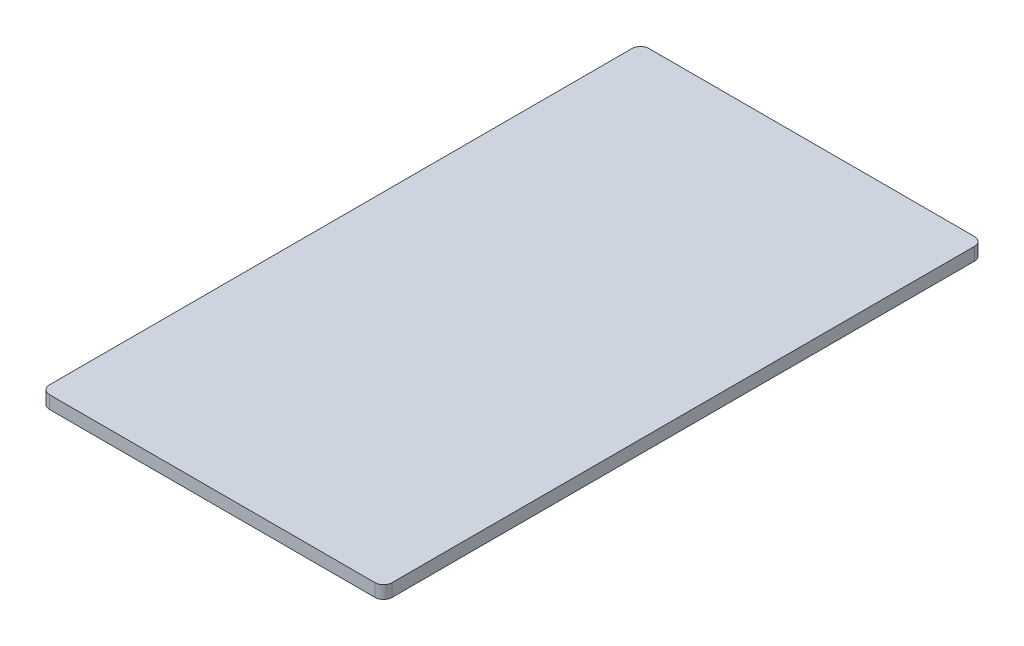
ISO-10303-21;
HEADER;
FILE_DESCRIPTION(('STEP AP214'),'2;1');
FILE_NAME('part.step','',(''),(''),'','','');
FILE_SCHEMA(('AUTOMOTIVE_DESIGN { 1 0 10303 214 1 1 1 1 }'));
ENDSEC;
DATA;
#1=APPLICATION_CONTEXT('core data for automotive mechanical design processes');
#2=APPLICATION_PROTOCOL_DEFINITION('international standard','automotive_design',2000,#1);
#3=PRODUCT_CONTEXT('',#1,'mechanical');
#4=PRODUCT('Part','Part','',(#3));
#5=PRODUCT_RELATED_PRODUCT_CATEGORY('part','',(#4));
#6=PRODUCT_DEFINITION_FORMATION('','',#4);
#7=PRODUCT_DEFINITION_CONTEXT('part definition',#1,'design');
#8=PRODUCT_DEFINITION('design','',#6,#7);
#9=PRODUCT_DEFINITION_SHAPE('','',#8);
#10=(LENGTH_UNIT() NAMED_UNIT(*) SI_UNIT(.MILLI.,.METRE.));
#11=(NAMED_UNIT(*) PLANE_ANGLE_UNIT() SI_UNIT($,.RADIAN.));
#12=(NAMED_UNIT(*) SI_UNIT($,.STERADIAN.) SOLID_ANGLE_UNIT());
#13=UNCERTAINTY_MEASURE_WITH_UNIT(LENGTH_MEASURE(1.E-05),#10,'distance_accuracy_value','');
#14=(GEOMETRIC_REPRESENTATION_CONTEXT(3) GLOBAL_UNCERTAINTY_ASSIGNED_CONTEXT((#13)) GLOBAL_UNIT_ASSIGNED_CONTEXT((#10,
#11,#12)) REPRESENTATION_CONTEXT('',''));
#15=CARTESIAN_POINT('',(0.,0.,0.));
#16=DIRECTION('',(0.,0.,1.));
#17=DIRECTION('',(1.,0.,0.));
#18=AXIS2_PLACEMENT_3D('',#15,#16,#17);
#19=CARTESIAN_POINT('',(20.,1.5,-35.));
#20=DIRECTION('',(-1.,0.,0.));
#21=DIRECTION('',(0.,0.,1.));
#22=AXIS2_PLACEMENT_3D('',#19,#20,#21);
#23=PLANE('',#22);
#24=DIRECTION('',(0.,0.,-1.));
#25=VECTOR('',#24,1.);
#26=CARTESIAN_POINT('',(20.,0.,-35.));
#27=LINE('',#26,#25);
#28=CARTESIAN_POINT('',(20.,0.,34.));
#29=VERTEX_POINT('',#28);
#30=CARTESIAN_POINT('',(20.,0.,-34.));
#31=VERTEX_POINT('',#30);
#32=EDGE_CURVE('E127',#29,#31,#27,.T.);
#33=ORIENTED_EDGE('',*,*,#32,.T.);
#34=DIRECTION('',(0.,-1.,0.));
#35=VECTOR('',#34,1.);
#36=CARTESIAN_POINT('',(20.,1.5,-34.));
#37=LINE('',#36,#35);
#38=CARTESIAN_POINT('',(20.,1.5,-34.));
#39=VERTEX_POINT('',#38);
#40=EDGE_CURVE('E105',#31,#39,#37,.F.);
#41=ORIENTED_EDGE('',*,*,#40,.T.);
#42=DIRECTION('',(0.,0.,-1.));
#43=VECTOR('',#42,1.);
#44=CARTESIAN_POINT('',(20.,1.5,-35.));
#45=LINE('',#44,#43);
#46=CARTESIAN_POINT('',(20.,1.5,34.));
#47=VERTEX_POINT('',#46);
#48=EDGE_CURVE('E136',#47,#39,#45,.T.);
#49=ORIENTED_EDGE('',*,*,#48,.F.);
#50=DIRECTION('',(0.,-1.,0.));
#51=VECTOR('',#50,1.);
#52=CARTESIAN_POINT('',(20.,1.5,34.));
#53=LINE('',#52,#51);
#54=EDGE_CURVE('E110',#47,#29,#53,.T.);
#55=ORIENTED_EDGE('',*,*,#54,.T.);
#56=EDGE_LOOP('',(#33,#41,#49,#55));
#57=FACE_BOUND('',#56,.T.);
#58=ADVANCED_FACE('F35',(#57),#23,.F.);
#59=CARTESIAN_POINT('',(-20.,1.5,-35.));
#60=DIRECTION('',(0.,0.,1.));
#61=DIRECTION('',(1.,0.,0.));
#62=AXIS2_PLACEMENT_3D('',#59,#60,#61);
#63=PLANE('',#62);
#64=DIRECTION('',(-1.,0.,0.));
#65=VECTOR('',#64,1.);
#66=CARTESIAN_POINT('',(-20.,1.5,-35.));
#67=LINE('',#66,#65);
#68=CARTESIAN_POINT('',(19.,1.5,-35.));
#69=VERTEX_POINT('',#68);
#70=CARTESIAN_POINT('',(-19.,1.5,-35.));
#71=VERTEX_POINT('',#70);
#72=EDGE_CURVE('E120',#69,#71,#67,.T.);
#73=ORIENTED_EDGE('',*,*,#72,.F.);
#74=DIRECTION('',(0.,-1.,0.));
#75=VECTOR('',#74,1.);
#76=CARTESIAN_POINT('',(19.,1.5,-35.));
#77=LINE('',#76,#75);
#78=CARTESIAN_POINT('',(19.,0.,-35.));
#79=VERTEX_POINT('',#78);
#80=EDGE_CURVE('E104',#69,#79,#77,.T.);
#81=ORIENTED_EDGE('',*,*,#80,.T.);
#82=DIRECTION('',(-1.,0.,0.));
#83=VECTOR('',#82,1.);
#84=CARTESIAN_POINT('',(-20.,0.,-35.));
#85=LINE('',#84,#83);
#86=CARTESIAN_POINT('',(-19.,0.,-35.));
#87=VERTEX_POINT('',#86);
#88=EDGE_CURVE('E117',#79,#87,#85,.T.);
#89=ORIENTED_EDGE('',*,*,#88,.T.);
#90=DIRECTION('',(0.,-1.,0.));
#91=VECTOR('',#90,1.);
#92=CARTESIAN_POINT('',(-19.,1.5,-35.));
#93=LINE('',#92,#91);
#94=EDGE_CURVE('E122',#87,#71,#93,.F.);
#95=ORIENTED_EDGE('',*,*,#94,.T.);
#96=EDGE_LOOP('',(#73,#81,#89,#95));
#97=FACE_BOUND('',#96,.T.);
#98=ADVANCED_FACE('F116',(#97),#63,.F.);
#99=CARTESIAN_POINT('',(-20.,1.5,-35.));
#100=DIRECTION('',(1.,0.,0.));
#101=DIRECTION('',(0.,0.,-1.));
#102=AXIS2_PLACEMENT_3D('',#99,#100,#101);
#103=PLANE('',#102);
#104=DIRECTION('',(0.,0.,1.));
#105=VECTOR('',#104,1.);
#106=CARTESIAN_POINT('',(-20.,1.5,-35.));
#107=LINE('',#106,#105);
#108=CARTESIAN_POINT('',(-20.,1.5,-34.));
#109=VERTEX_POINT('',#108);
#110=CARTESIAN_POINT('',(-20.,1.5,34.));
#111=VERTEX_POINT('',#110);
#112=EDGE_CURVE('E170',#109,#111,#107,.T.);
#113=ORIENTED_EDGE('',*,*,#112,.F.);
#114=DIRECTION('',(0.,-1.,0.));
#115=VECTOR('',#114,1.);
#116=CARTESIAN_POINT('',(-20.,1.5,-34.));
#117=LINE('',#116,#115);
#118=CARTESIAN_POINT('',(-20.,0.,-34.));
#119=VERTEX_POINT('',#118);
#120=EDGE_CURVE('E155',#109,#119,#117,.T.);
#121=ORIENTED_EDGE('',*,*,#120,.T.);
#122=DIRECTION('',(0.,0.,1.));
#123=VECTOR('',#122,1.);
#124=CARTESIAN_POINT('',(-20.,0.,-35.));
#125=LINE('',#124,#123);
#126=CARTESIAN_POINT('',(-20.,0.,34.));
#127=VERTEX_POINT('',#126);
#128=EDGE_CURVE('E126',#119,#127,#125,.T.);
#129=ORIENTED_EDGE('',*,*,#128,.T.);
#130=DIRECTION('',(0.,-1.,0.));
#131=VECTOR('',#130,1.);
#132=CARTESIAN_POINT('',(-20.,1.5,34.));
#133=LINE('',#132,#131);
#134=EDGE_CURVE('E153',#127,#111,#133,.F.);
#135=ORIENTED_EDGE('',*,*,#134,.T.);
#136=EDGE_LOOP('',(#113,#121,#129,#135));
#137=FACE_BOUND('',#136,.T.);
#138=ADVANCED_FACE('F181',(#137),#103,.F.);
#139=CARTESIAN_POINT('',(-20.,1.5,35.));
#140=DIRECTION('',(0.,0.,-1.));
#141=DIRECTION('',(-1.,0.,0.));
#142=AXIS2_PLACEMENT_3D('',#139,#140,#141);
#143=PLANE('',#142);
#144=DIRECTION('',(1.,0.,0.));
#145=VECTOR('',#144,1.);
#146=CARTESIAN_POINT('',(-20.,0.,35.));
#147=LINE('',#146,#145);
#148=CARTESIAN_POINT('',(-19.,0.,35.));
#149=VERTEX_POINT('',#148);
#150=CARTESIAN_POINT('',(19.,0.,35.));
#151=VERTEX_POINT('',#150);
#152=EDGE_CURVE('E130',#149,#151,#147,.T.);
#153=ORIENTED_EDGE('',*,*,#152,.T.);
#154=DIRECTION('',(0.,-1.,0.));
#155=VECTOR('',#154,1.);
#156=CARTESIAN_POINT('',(19.,1.5,35.));
#157=LINE('',#156,#155);
#158=CARTESIAN_POINT('',(19.,1.5,35.));
#159=VERTEX_POINT('',#158);
#160=EDGE_CURVE('E11',#151,#159,#157,.F.);
#161=ORIENTED_EDGE('',*,*,#160,.T.);
#162=DIRECTION('',(1.,0.,0.));
#163=VECTOR('',#162,1.);
#164=CARTESIAN_POINT('',(-20.,1.5,35.));
#165=LINE('',#164,#163);
#166=CARTESIAN_POINT('',(-19.,1.5,35.));
#167=VERTEX_POINT('',#166);
#168=EDGE_CURVE('E137',#167,#159,#165,.T.);
#169=ORIENTED_EDGE('',*,*,#168,.F.);
#170=DIRECTION('',(0.,-1.,0.));
#171=VECTOR('',#170,1.);
#172=CARTESIAN_POINT('',(-19.,1.5,35.));
#173=LINE('',#172,#171);
#174=EDGE_CURVE('E43',#167,#149,#173,.T.);
#175=ORIENTED_EDGE('',*,*,#174,.T.);
#176=EDGE_LOOP('',(#153,#161,#169,#175));
#177=FACE_BOUND('',#176,.T.);
#178=ADVANCED_FACE('F160',(#177),#143,.F.);
#179=CARTESIAN_POINT('',(0.,1.5,0.));
#180=DIRECTION('',(0.,1.,0.));
#181=DIRECTION('',(0.,0.,1.));
#182=AXIS2_PLACEMENT_3D('',#179,#180,#181);
#183=PLANE('',#182);
#184=ORIENTED_EDGE('',*,*,#48,.T.);
#185=CARTESIAN_POINT('',(19.,1.5,-34.));
#186=DIRECTION('',(0.,1.,0.));
#187=DIRECTION('',(0.,0.,1.));
#188=AXIS2_PLACEMENT_3D('',#185,#186,#187);
#189=CIRCLE('',#188,1.);
#190=EDGE_CURVE('E151',#39,#69,#189,.T.);
#191=ORIENTED_EDGE('',*,*,#190,.T.);
#192=ORIENTED_EDGE('',*,*,#72,.T.);
#193=CARTESIAN_POINT('',(-19.,1.5,-34.));
#194=DIRECTION('',(0.,1.,0.));
#195=DIRECTION('',(0.,0.,1.));
#196=AXIS2_PLACEMENT_3D('',#193,#194,#195);
#197=CIRCLE('',#196,1.);
#198=EDGE_CURVE('E149',#71,#109,#197,.T.);
#199=ORIENTED_EDGE('',*,*,#198,.T.);
#200=ORIENTED_EDGE('',*,*,#112,.T.);
#201=CARTESIAN_POINT('',(-19.,1.5,34.));
#202=DIRECTION('',(0.,1.,0.));
#203=DIRECTION('',(0.,0.,1.));
#204=AXIS2_PLACEMENT_3D('',#201,#202,#203);
#205=CIRCLE('',#204,1.);
#206=EDGE_CURVE('E55',#111,#167,#205,.T.);
#207=ORIENTED_EDGE('',*,*,#206,.T.);
#208=ORIENTED_EDGE('',*,*,#168,.T.);
#209=CARTESIAN_POINT('',(19.,1.5,34.));
#210=DIRECTION('',(0.,1.,0.));
#211=DIRECTION('',(0.,0.,1.));
#212=AXIS2_PLACEMENT_3D('',#209,#210,#211);
#213=CIRCLE('',#212,1.);
#214=EDGE_CURVE('E147',#159,#47,#213,.T.);
#215=ORIENTED_EDGE('',*,*,#214,.T.);
#216=EDGE_LOOP('',(#184,#191,#192,#199,#200,#207,#208,#215));
#217=FACE_BOUND('',#216,.T.);
#218=ADVANCED_FACE('F173',(#217),#183,.T.);
#219=CARTESIAN_POINT('',(0.,0.,0.));
#220=DIRECTION('',(0.,1.,0.));
#221=DIRECTION('',(0.,0.,1.));
#222=AXIS2_PLACEMENT_3D('',#219,#220,#221);
#223=PLANE('',#222);
#224=ORIENTED_EDGE('',*,*,#88,.F.);
#225=CARTESIAN_POINT('',(19.,0.,-34.));
#226=DIRECTION('',(0.,1.,0.));
#227=DIRECTION('',(0.,0.,1.));
#228=AXIS2_PLACEMENT_3D('',#225,#226,#227);
#229=CIRCLE('',#228,1.);
#230=EDGE_CURVE('E100',#79,#31,#229,.F.);
#231=ORIENTED_EDGE('',*,*,#230,.T.);
#232=ORIENTED_EDGE('',*,*,#32,.F.);
#233=CARTESIAN_POINT('',(19.,0.,34.));
#234=DIRECTION('',(0.,1.,0.));
#235=DIRECTION('',(0.,0.,1.));
#236=AXIS2_PLACEMENT_3D('',#233,#234,#235);
#237=CIRCLE('',#236,1.);
#238=EDGE_CURVE('E140',#29,#151,#237,.F.);
#239=ORIENTED_EDGE('',*,*,#238,.T.);
#240=ORIENTED_EDGE('',*,*,#152,.F.);
#241=CARTESIAN_POINT('',(-19.,0.,34.));
#242=DIRECTION('',(0.,1.,0.));
#243=DIRECTION('',(0.,0.,1.));
#244=AXIS2_PLACEMENT_3D('',#241,#242,#243);
#245=CIRCLE('',#244,1.);
#246=EDGE_CURVE('E121',#149,#127,#245,.F.);
#247=ORIENTED_EDGE('',*,*,#246,.T.);
#248=ORIENTED_EDGE('',*,*,#128,.F.);
#249=CARTESIAN_POINT('',(-19.,0.,-34.));
#250=DIRECTION('',(0.,1.,0.));
#251=DIRECTION('',(0.,0.,1.));
#252=AXIS2_PLACEMENT_3D('',#249,#250,#251);
#253=CIRCLE('',#252,1.);
#254=EDGE_CURVE('E111',#119,#87,#253,.F.);
#255=ORIENTED_EDGE('',*,*,#254,.T.);
#256=EDGE_LOOP('',(#224,#231,#232,#239,#240,#247,#248,#255));
#257=FACE_BOUND('',#256,.T.);
#258=ADVANCED_FACE('F124',(#257),#223,.F.);
#259=CARTESIAN_POINT('',(19.,1.5,-34.));
#260=DIRECTION('',(0.,-1.,0.));
#261=DIRECTION('',(0.,0.,-1.));
#262=AXIS2_PLACEMENT_3D('',#259,#260,#261);
#263=CYLINDRICAL_SURFACE('',#262,1.);
#264=ORIENTED_EDGE('',*,*,#190,.F.);
#265=ORIENTED_EDGE('',*,*,#40,.F.);
#266=ORIENTED_EDGE('',*,*,#230,.F.);
#267=ORIENTED_EDGE('',*,*,#80,.F.);
#268=EDGE_LOOP('',(#264,#265,#266,#267));
#269=FACE_BOUND('',#268,.T.);
#270=ADVANCED_FACE('F103',(#269),#263,.T.);
#271=CARTESIAN_POINT('',(-19.,1.5,-34.));
#272=DIRECTION('',(0.,-1.,0.));
#273=DIRECTION('',(0.,0.,-1.));
#274=AXIS2_PLACEMENT_3D('',#271,#272,#273);
#275=CYLINDRICAL_SURFACE('',#274,1.);
#276=ORIENTED_EDGE('',*,*,#198,.F.);
#277=ORIENTED_EDGE('',*,*,#94,.F.);
#278=ORIENTED_EDGE('',*,*,#254,.F.);
#279=ORIENTED_EDGE('',*,*,#120,.F.);
#280=EDGE_LOOP('',(#276,#277,#278,#279));
#281=FACE_BOUND('',#280,.T.);
#282=ADVANCED_FACE('F193',(#281),#275,.T.);
#283=CARTESIAN_POINT('',(19.,1.5,34.));
#284=DIRECTION('',(0.,-1.,0.));
#285=DIRECTION('',(0.,0.,-1.));
#286=AXIS2_PLACEMENT_3D('',#283,#284,#285);
#287=CYLINDRICAL_SURFACE('',#286,1.);
#288=ORIENTED_EDGE('',*,*,#214,.F.);
#289=ORIENTED_EDGE('',*,*,#160,.F.);
#290=ORIENTED_EDGE('',*,*,#238,.F.);
#291=ORIENTED_EDGE('',*,*,#54,.F.);
#292=EDGE_LOOP('',(#288,#289,#290,#291));
#293=FACE_BOUND('',#292,.T.);
#294=ADVANCED_FACE('F165',(#293),#287,.T.);
#295=CARTESIAN_POINT('',(-19.,1.5,34.));
#296=DIRECTION('',(0.,-1.,0.));
#297=DIRECTION('',(0.,0.,-1.));
#298=AXIS2_PLACEMENT_3D('',#295,#296,#297);
#299=CYLINDRICAL_SURFACE('',#298,1.);
#300=ORIENTED_EDGE('',*,*,#206,.F.);
#301=ORIENTED_EDGE('',*,*,#134,.F.);
#302=ORIENTED_EDGE('',*,*,#246,.F.);
#303=ORIENTED_EDGE('',*,*,#174,.F.);
#304=EDGE_LOOP('',(#300,#301,#302,#303));
#305=FACE_BOUND('',#304,.T.);
#306=ADVANCED_FACE('F37',(#305),#299,.T.);
#307=CLOSED_SHELL('',(#58,#98,#138,#178,#218,#258,#270,#282,#294,#306));
#308=MANIFOLD_SOLID_BREP('B2',#307);
#309=ADVANCED_BREP_SHAPE_REPRESENTATION('',(#18,#308),#14);
#310=SHAPE_DEFINITION_REPRESENTATION(#9,#309);
ENDSEC;
END-ISO-10303-21;
